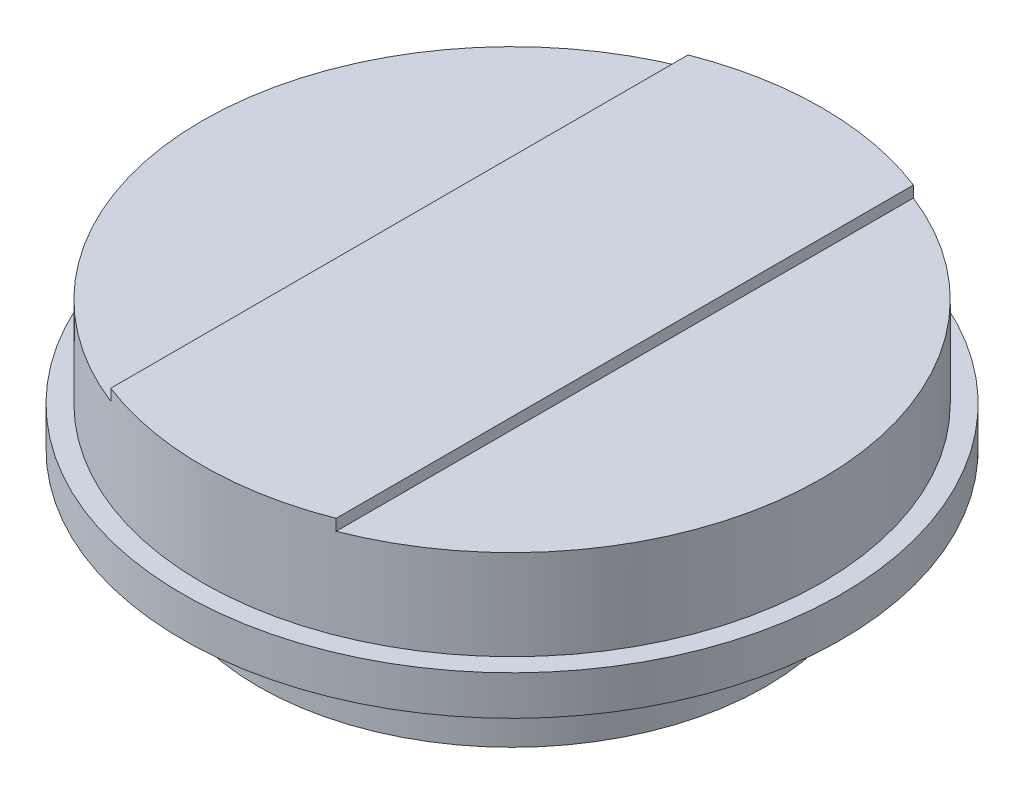
ISO-10303-21;
HEADER;
FILE_DESCRIPTION(('STEP AP214'),'2;1');
FILE_NAME('part.step','',(''),(''),'','','');
FILE_SCHEMA(('AUTOMOTIVE_DESIGN { 1 0 10303 214 1 1 1 1 }'));
ENDSEC;
DATA;
#1=APPLICATION_CONTEXT('core data for automotive mechanical design processes');
#2=APPLICATION_PROTOCOL_DEFINITION('international standard','automotive_design',2000,#1);
#3=PRODUCT_CONTEXT('',#1,'mechanical');
#4=PRODUCT('Part','Part','',(#3));
#5=PRODUCT_RELATED_PRODUCT_CATEGORY('part','',(#4));
#6=PRODUCT_DEFINITION_FORMATION('','',#4);
#7=PRODUCT_DEFINITION_CONTEXT('part definition',#1,'design');
#8=PRODUCT_DEFINITION('design','',#6,#7);
#9=PRODUCT_DEFINITION_SHAPE('','',#8);
#10=(LENGTH_UNIT() NAMED_UNIT(*) SI_UNIT(.MILLI.,.METRE.));
#11=(NAMED_UNIT(*) PLANE_ANGLE_UNIT() SI_UNIT($,.RADIAN.));
#12=(NAMED_UNIT(*) SI_UNIT($,.STERADIAN.) SOLID_ANGLE_UNIT());
#13=UNCERTAINTY_MEASURE_WITH_UNIT(LENGTH_MEASURE(1.E-05),#10,'distance_accuracy_value','');
#14=(GEOMETRIC_REPRESENTATION_CONTEXT(3) GLOBAL_UNCERTAINTY_ASSIGNED_CONTEXT((#13)) GLOBAL_UNIT_ASSIGNED_CONTEXT((#10,
#11,#12)) REPRESENTATION_CONTEXT('',''));
#15=CARTESIAN_POINT('',(0.,0.,0.));
#16=DIRECTION('',(0.,0.,1.));
#17=DIRECTION('',(1.,0.,0.));
#18=AXIS2_PLACEMENT_3D('',#15,#16,#17);
#19=CARTESIAN_POINT('',(55.,57.,0.));
#20=DIRECTION('',(0.,1.,0.));
#21=DIRECTION('',(0.,0.,1.));
#22=AXIS2_PLACEMENT_3D('',#19,#20,#21);
#23=PLANE('',#22);
#24=DIRECTION('',(0.,0.,1.));
#25=VECTOR('',#24,1.);
#26=CARTESIAN_POINT('',(20.,57.,-51.234753829798));
#27=LINE('',#26,#25);
#28=CARTESIAN_POINT('',(20.,57.,-51.234753829798));
#29=VERTEX_POINT('',#28);
#30=CARTESIAN_POINT('',(20.,57.,51.234753829798));
#31=VERTEX_POINT('',#30);
#32=EDGE_CURVE('E84',#29,#31,#27,.T.);
#33=ORIENTED_EDGE('',*,*,#32,.T.);
#34=CARTESIAN_POINT('',(0.,57.,0.));
#35=DIRECTION('',(0.,-1.,0.));
#36=DIRECTION('',(0.,0.,-1.));
#37=AXIS2_PLACEMENT_3D('',#34,#35,#36);
#38=CIRCLE('',#37,55.);
#39=EDGE_CURVE('E21',#29,#31,#38,.T.);
#40=ORIENTED_EDGE('',*,*,#39,.F.);
#41=EDGE_LOOP('',(#33,#40));
#42=FACE_BOUND('',#41,.T.);
#43=ADVANCED_FACE('F18',(#42),#23,.T.);
#44=CARTESIAN_POINT('',(20.,59.,-51.234753829798));
#45=DIRECTION('',(-1.,0.,0.));
#46=DIRECTION('',(0.,0.,1.));
#47=AXIS2_PLACEMENT_3D('',#44,#45,#46);
#48=PLANE('',#47);
#49=DIRECTION('',(0.,-1.,0.));
#50=VECTOR('',#49,1.);
#51=CARTESIAN_POINT('',(20.,0.,-51.234753829798));
#52=LINE('',#51,#50);
#53=CARTESIAN_POINT('',(20.,59.,-51.234753829798));
#54=VERTEX_POINT('',#53);
#55=EDGE_CURVE('E74',#54,#29,#52,.T.);
#56=ORIENTED_EDGE('',*,*,#55,.F.);
#57=DIRECTION('',(0.,0.,-1.));
#58=VECTOR('',#57,1.);
#59=CARTESIAN_POINT('',(20.,59.,0.));
#60=LINE('',#59,#58);
#61=CARTESIAN_POINT('',(20.,59.,51.234753829798));
#62=VERTEX_POINT('',#61);
#63=EDGE_CURVE('E64',#54,#62,#60,.F.);
#64=ORIENTED_EDGE('',*,*,#63,.T.);
#65=DIRECTION('',(0.,-1.,0.));
#66=VECTOR('',#65,1.);
#67=CARTESIAN_POINT('',(20.,0.,51.234753829798));
#68=LINE('',#67,#66);
#69=EDGE_CURVE('E69',#31,#62,#68,.F.);
#70=ORIENTED_EDGE('',*,*,#69,.F.);
#71=ORIENTED_EDGE('',*,*,#32,.F.);
#72=EDGE_LOOP('',(#56,#64,#70,#71));
#73=FACE_BOUND('',#72,.T.);
#74=ADVANCED_FACE('F72',(#73),#48,.F.);
#75=CARTESIAN_POINT('',(55.,57.,0.));
#76=DIRECTION('',(0.,1.,0.));
#77=DIRECTION('',(0.,0.,1.));
#78=AXIS2_PLACEMENT_3D('',#75,#76,#77);
#79=PLANE('',#78);
#80=DIRECTION('',(0.,0.,-1.));
#81=VECTOR('',#80,1.);
#82=CARTESIAN_POINT('',(-20.,57.,-51.234753829798));
#83=LINE('',#82,#81);
#84=CARTESIAN_POINT('',(-20.,57.,51.234753829798));
#85=VERTEX_POINT('',#84);
#86=CARTESIAN_POINT('',(-20.,57.,-51.234753829798));
#87=VERTEX_POINT('',#86);
#88=EDGE_CURVE('E75',#85,#87,#83,.T.);
#89=ORIENTED_EDGE('',*,*,#88,.T.);
#90=CARTESIAN_POINT('',(0.,57.,0.));
#91=DIRECTION('',(0.,-1.,0.));
#92=DIRECTION('',(0.,0.,-1.));
#93=AXIS2_PLACEMENT_3D('',#90,#91,#92);
#94=CIRCLE('',#93,55.);
#95=EDGE_CURVE('E111',#85,#87,#94,.T.);
#96=ORIENTED_EDGE('',*,*,#95,.F.);
#97=EDGE_LOOP('',(#89,#96));
#98=FACE_BOUND('',#97,.T.);
#99=ADVANCED_FACE('F118',(#98),#79,.T.);
#100=CARTESIAN_POINT('',(-20.,59.,-51.234753829798));
#101=DIRECTION('',(1.,0.,0.));
#102=DIRECTION('',(0.,0.,-1.));
#103=AXIS2_PLACEMENT_3D('',#100,#101,#102);
#104=PLANE('',#103);
#105=DIRECTION('',(0.,-1.,0.));
#106=VECTOR('',#105,1.);
#107=CARTESIAN_POINT('',(-20.,0.,51.234753829798));
#108=LINE('',#107,#106);
#109=CARTESIAN_POINT('',(-20.,59.,51.234753829798));
#110=VERTEX_POINT('',#109);
#111=EDGE_CURVE('E68',#110,#85,#108,.T.);
#112=ORIENTED_EDGE('',*,*,#111,.F.);
#113=DIRECTION('',(0.,0.,-1.));
#114=VECTOR('',#113,1.);
#115=CARTESIAN_POINT('',(-20.,59.,0.));
#116=LINE('',#115,#114);
#117=CARTESIAN_POINT('',(-20.,59.,-51.234753829798));
#118=VERTEX_POINT('',#117);
#119=EDGE_CURVE('E36',#110,#118,#116,.T.);
#120=ORIENTED_EDGE('',*,*,#119,.T.);
#121=DIRECTION('',(0.,-1.,0.));
#122=VECTOR('',#121,1.);
#123=CARTESIAN_POINT('',(-20.,0.,-51.234753829798));
#124=LINE('',#123,#122);
#125=EDGE_CURVE('E110',#87,#118,#124,.F.);
#126=ORIENTED_EDGE('',*,*,#125,.F.);
#127=ORIENTED_EDGE('',*,*,#88,.F.);
#128=EDGE_LOOP('',(#112,#120,#126,#127));
#129=FACE_BOUND('',#128,.T.);
#130=ADVANCED_FACE('F119',(#129),#104,.F.);
#131=CARTESIAN_POINT('',(0.,59.,0.));
#132=DIRECTION('',(0.,-1.,0.));
#133=DIRECTION('',(0.,0.,-1.));
#134=AXIS2_PLACEMENT_3D('',#131,#132,#133);
#135=PLANE('',#134);
#136=CARTESIAN_POINT('',(0.,59.,0.));
#137=DIRECTION('',(0.,-1.,0.));
#138=DIRECTION('',(0.,0.,-1.));
#139=AXIS2_PLACEMENT_3D('',#136,#137,#138);
#140=CIRCLE('',#139,55.);
#141=EDGE_CURVE('E56',#118,#54,#140,.T.);
#142=ORIENTED_EDGE('',*,*,#141,.F.);
#143=ORIENTED_EDGE('',*,*,#119,.F.);
#144=CARTESIAN_POINT('',(0.,59.,0.));
#145=DIRECTION('',(0.,-1.,0.));
#146=DIRECTION('',(0.,0.,-1.));
#147=AXIS2_PLACEMENT_3D('',#144,#145,#146);
#148=CIRCLE('',#147,55.);
#149=EDGE_CURVE('E61',#62,#110,#148,.T.);
#150=ORIENTED_EDGE('',*,*,#149,.F.);
#151=ORIENTED_EDGE('',*,*,#63,.F.);
#152=EDGE_LOOP('',(#142,#143,#150,#151));
#153=FACE_BOUND('',#152,.T.);
#154=ADVANCED_FACE('F63',(#153),#135,.F.);
#155=CARTESIAN_POINT('',(0.,0.,0.));
#156=DIRECTION('',(0.,-1.,0.));
#157=DIRECTION('',(0.,0.,-1.));
#158=AXIS2_PLACEMENT_3D('',#155,#156,#157);
#159=CYLINDRICAL_SURFACE('',#158,55.);
#160=ORIENTED_EDGE('',*,*,#69,.T.);
#161=ORIENTED_EDGE('',*,*,#149,.T.);
#162=ORIENTED_EDGE('',*,*,#111,.T.);
#163=ORIENTED_EDGE('',*,*,#95,.T.);
#164=ORIENTED_EDGE('',*,*,#125,.T.);
#165=ORIENTED_EDGE('',*,*,#141,.T.);
#166=ORIENTED_EDGE('',*,*,#55,.T.);
#167=ORIENTED_EDGE('',*,*,#39,.T.);
#168=EDGE_LOOP('',(#160,#161,#162,#163,#164,#165,#166,#167));
#169=FACE_BOUND('',#168,.T.);
#170=CARTESIAN_POINT('',(0.,41.,0.));
#171=DIRECTION('',(0.,-1.,0.));
#172=DIRECTION('',(0.,0.,-1.));
#173=AXIS2_PLACEMENT_3D('',#170,#171,#172);
#174=CIRCLE('',#173,55.);
#175=CARTESIAN_POINT('',(0.,41.,-55.));
#176=VERTEX_POINT('',#175);
#177=EDGE_CURVE('E106',#176,#176,#174,.T.);
#178=ORIENTED_EDGE('',*,*,#177,.F.);
#179=EDGE_LOOP('',(#178));
#180=FACE_BOUND('',#179,.T.);
#181=ADVANCED_FACE('F77',(#169,#180),#159,.T.);
#182=CARTESIAN_POINT('',(58.5,41.,0.));
#183=DIRECTION('',(0.,1.,0.));
#184=DIRECTION('',(0.,0.,1.));
#185=AXIS2_PLACEMENT_3D('',#182,#183,#184);
#186=PLANE('',#185);
#187=CARTESIAN_POINT('',(0.,41.,0.));
#188=DIRECTION('',(0.,-1.,0.));
#189=DIRECTION('',(0.,0.,-1.));
#190=AXIS2_PLACEMENT_3D('',#187,#188,#189);
#191=CIRCLE('',#190,58.5);
#192=CARTESIAN_POINT('',(0.,41.,-58.5));
#193=VERTEX_POINT('',#192);
#194=EDGE_CURVE('E103',#193,#193,#191,.T.);
#195=ORIENTED_EDGE('',*,*,#194,.F.);
#196=EDGE_LOOP('',(#195));
#197=FACE_BOUND('',#196,.T.);
#198=ORIENTED_EDGE('',*,*,#177,.T.);
#199=EDGE_LOOP('',(#198));
#200=FACE_BOUND('',#199,.T.);
#201=ADVANCED_FACE('F164',(#197,#200),#186,.T.);
#202=CARTESIAN_POINT('',(0.,18.,0.));
#203=DIRECTION('',(0.,-1.,0.));
#204=DIRECTION('',(0.,0.,-1.));
#205=AXIS2_PLACEMENT_3D('',#202,#203,#204);
#206=PLANE('',#205);
#207=CARTESIAN_POINT('',(0.,18.,0.));
#208=DIRECTION('',(0.,-1.,0.));
#209=DIRECTION('',(0.,0.,-1.));
#210=AXIS2_PLACEMENT_3D('',#207,#208,#209);
#211=CIRCLE('',#210,5.);
#212=CARTESIAN_POINT('',(0.,18.,-5.));
#213=VERTEX_POINT('',#212);
#214=EDGE_CURVE('E100',#213,#213,#211,.T.);
#215=ORIENTED_EDGE('',*,*,#214,.T.);
#216=EDGE_LOOP('',(#215));
#217=FACE_BOUND('',#216,.T.);
#218=ADVANCED_FACE('F160',(#217),#206,.T.);
#219=CARTESIAN_POINT('',(0.,0.,0.));
#220=DIRECTION('',(0.,-1.,0.));
#221=DIRECTION('',(0.,0.,-1.));
#222=AXIS2_PLACEMENT_3D('',#219,#220,#221);
#223=CYLINDRICAL_SURFACE('',#222,58.5);
#224=ORIENTED_EDGE('',*,*,#194,.T.);
#225=EDGE_LOOP('',(#224));
#226=FACE_BOUND('',#225,.T.);
#227=CARTESIAN_POINT('',(0.,34.,0.));
#228=DIRECTION('',(0.,-1.,0.));
#229=DIRECTION('',(0.,0.,-1.));
#230=AXIS2_PLACEMENT_3D('',#227,#228,#229);
#231=CIRCLE('',#230,58.5);
#232=CARTESIAN_POINT('',(0.,34.,-58.5));
#233=VERTEX_POINT('',#232);
#234=EDGE_CURVE('E97',#233,#233,#231,.T.);
#235=ORIENTED_EDGE('',*,*,#234,.F.);
#236=EDGE_LOOP('',(#235));
#237=FACE_BOUND('',#236,.T.);
#238=ADVANCED_FACE('F156',(#226,#237),#223,.T.);
#239=CARTESIAN_POINT('',(0.,0.,0.));
#240=DIRECTION('',(0.,-1.,0.));
#241=DIRECTION('',(0.,0.,-1.));
#242=AXIS2_PLACEMENT_3D('',#239,#240,#241);
#243=CYLINDRICAL_SURFACE('',#242,5.);
#244=CARTESIAN_POINT('',(0.,0.,0.));
#245=DIRECTION('',(0.,-1.,0.));
#246=DIRECTION('',(0.,0.,-1.));
#247=AXIS2_PLACEMENT_3D('',#244,#245,#246);
#248=CIRCLE('',#247,5.);
#249=CARTESIAN_POINT('',(0.,0.,-5.));
#250=VERTEX_POINT('',#249);
#251=EDGE_CURVE('E94',#250,#250,#248,.F.);
#252=ORIENTED_EDGE('',*,*,#251,.F.);
#253=EDGE_LOOP('',(#252));
#254=FACE_BOUND('',#253,.T.);
#255=ORIENTED_EDGE('',*,*,#214,.F.);
#256=EDGE_LOOP('',(#255));
#257=FACE_BOUND('',#256,.T.);
#258=ADVANCED_FACE('F152',(#254,#257),#243,.F.);
#259=CARTESIAN_POINT('',(45.,34.,0.));
#260=DIRECTION('',(0.,-1.,0.));
#261=DIRECTION('',(0.,0.,-1.));
#262=AXIS2_PLACEMENT_3D('',#259,#260,#261);
#263=PLANE('',#262);
#264=CARTESIAN_POINT('',(0.,34.,0.));
#265=DIRECTION('',(0.,-1.,0.));
#266=DIRECTION('',(0.,0.,-1.));
#267=AXIS2_PLACEMENT_3D('',#264,#265,#266);
#268=CIRCLE('',#267,45.);
#269=CARTESIAN_POINT('',(0.,34.,-45.));
#270=VERTEX_POINT('',#269);
#271=EDGE_CURVE('E91',#270,#270,#268,.T.);
#272=ORIENTED_EDGE('',*,*,#271,.F.);
#273=EDGE_LOOP('',(#272));
#274=FACE_BOUND('',#273,.T.);
#275=ORIENTED_EDGE('',*,*,#234,.T.);
#276=EDGE_LOOP('',(#275));
#277=FACE_BOUND('',#276,.T.);
#278=ADVANCED_FACE('F148',(#274,#277),#263,.T.);
#279=CARTESIAN_POINT('',(5.,0.,0.));
#280=DIRECTION('',(0.,-1.,0.));
#281=DIRECTION('',(0.,0.,-1.));
#282=AXIS2_PLACEMENT_3D('',#279,#280,#281);
#283=PLANE('',#282);
#284=ORIENTED_EDGE('',*,*,#251,.T.);
#285=EDGE_LOOP('',(#284));
#286=FACE_BOUND('',#285,.T.);
#287=CARTESIAN_POINT('',(0.,0.,0.));
#288=DIRECTION('',(0.,-1.,0.));
#289=DIRECTION('',(0.,0.,-1.));
#290=AXIS2_PLACEMENT_3D('',#287,#288,#289);
#291=CIRCLE('',#290,10.);
#292=CARTESIAN_POINT('',(0.,0.,-10.));
#293=VERTEX_POINT('',#292);
#294=EDGE_CURVE('E88',#293,#293,#291,.F.);
#295=ORIENTED_EDGE('',*,*,#294,.F.);
#296=EDGE_LOOP('',(#295));
#297=FACE_BOUND('',#296,.T.);
#298=ADVANCED_FACE('F144',(#286,#297),#283,.T.);
#299=CARTESIAN_POINT('',(0.,0.,0.));
#300=DIRECTION('',(0.,-1.,0.));
#301=DIRECTION('',(0.,0.,-1.));
#302=AXIS2_PLACEMENT_3D('',#299,#300,#301);
#303=CYLINDRICAL_SURFACE('',#302,45.);
#304=ORIENTED_EDGE('',*,*,#271,.T.);
#305=EDGE_LOOP('',(#304));
#306=FACE_BOUND('',#305,.T.);
#307=CARTESIAN_POINT('',(0.,20.,0.));
#308=DIRECTION('',(0.,-1.,0.));
#309=DIRECTION('',(0.,0.,-1.));
#310=AXIS2_PLACEMENT_3D('',#307,#308,#309);
#311=CIRCLE('',#310,45.);
#312=CARTESIAN_POINT('',(0.,20.,-45.));
#313=VERTEX_POINT('',#312);
#314=EDGE_CURVE('E27',#313,#313,#311,.T.);
#315=ORIENTED_EDGE('',*,*,#314,.F.);
#316=EDGE_LOOP('',(#315));
#317=FACE_BOUND('',#316,.T.);
#318=ADVANCED_FACE('F137',(#306,#317),#303,.T.);
#319=CARTESIAN_POINT('',(0.,0.,0.));
#320=DIRECTION('',(0.,-1.,0.));
#321=DIRECTION('',(0.,0.,-1.));
#322=AXIS2_PLACEMENT_3D('',#319,#320,#321);
#323=CYLINDRICAL_SURFACE('',#322,10.);
#324=CARTESIAN_POINT('',(0.,20.,0.));
#325=DIRECTION('',(0.,-1.,0.));
#326=DIRECTION('',(0.,0.,-1.));
#327=AXIS2_PLACEMENT_3D('',#324,#325,#326);
#328=CIRCLE('',#327,10.);
#329=CARTESIAN_POINT('',(0.,20.,-10.));
#330=VERTEX_POINT('',#329);
#331=EDGE_CURVE('E11',#330,#330,#328,.F.);
#332=ORIENTED_EDGE('',*,*,#331,.F.);
#333=EDGE_LOOP('',(#332));
#334=FACE_BOUND('',#333,.T.);
#335=ORIENTED_EDGE('',*,*,#294,.T.);
#336=EDGE_LOOP('',(#335));
#337=FACE_BOUND('',#336,.T.);
#338=ADVANCED_FACE('F131',(#334,#337),#323,.T.);
#339=CARTESIAN_POINT('',(10.,20.,0.));
#340=DIRECTION('',(0.,-1.,0.));
#341=DIRECTION('',(0.,0.,-1.));
#342=AXIS2_PLACEMENT_3D('',#339,#340,#341);
#343=PLANE('',#342);
#344=ORIENTED_EDGE('',*,*,#331,.T.);
#345=EDGE_LOOP('',(#344));
#346=FACE_BOUND('',#345,.T.);
#347=ORIENTED_EDGE('',*,*,#314,.T.);
#348=EDGE_LOOP('',(#347));
#349=FACE_BOUND('',#348,.T.);
#350=ADVANCED_FACE('F129',(#346,#349),#343,.T.);
#351=CLOSED_SHELL('',(#43,#74,#99,#130,#154,#181,#201,#218,#238,#258,#278,#298,#318,#338,#350));
#352=MANIFOLD_SOLID_BREP('B1',#351);
#353=ADVANCED_BREP_SHAPE_REPRESENTATION('',(#18,#352),#14);
#354=SHAPE_DEFINITION_REPRESENTATION(#9,#353);
ENDSEC;
END-ISO-10303-21;
